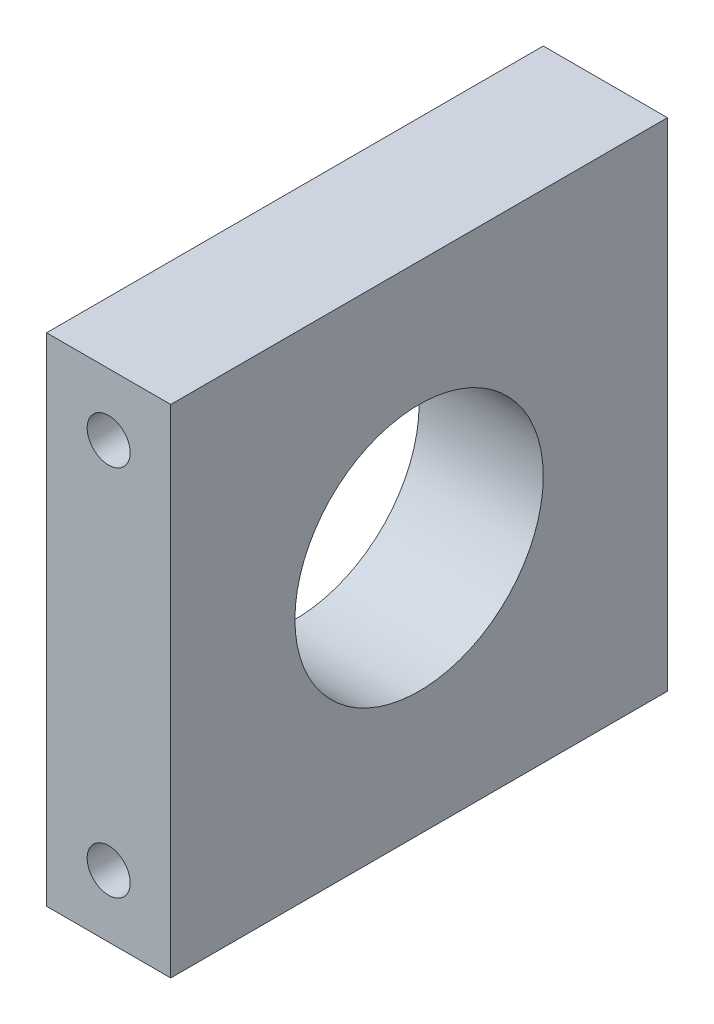
ISO-10303-21;
HEADER;
FILE_DESCRIPTION(('STEP AP214'),'2;1');
FILE_NAME('part.step','',(''),(''),'','','');
FILE_SCHEMA(('AUTOMOTIVE_DESIGN { 1 0 10303 214 1 1 1 1 }'));
ENDSEC;
DATA;
#1=APPLICATION_CONTEXT('core data for automotive mechanical design processes');
#2=APPLICATION_PROTOCOL_DEFINITION('international standard','automotive_design',2000,#1);
#3=PRODUCT_CONTEXT('',#1,'mechanical');
#4=PRODUCT('Part','Part','',(#3));
#5=PRODUCT_RELATED_PRODUCT_CATEGORY('part','',(#4));
#6=PRODUCT_DEFINITION_FORMATION('','',#4);
#7=PRODUCT_DEFINITION_CONTEXT('part definition',#1,'design');
#8=PRODUCT_DEFINITION('design','',#6,#7);
#9=PRODUCT_DEFINITION_SHAPE('','',#8);
#10=(LENGTH_UNIT() NAMED_UNIT(*) SI_UNIT(.MILLI.,.METRE.));
#11=(NAMED_UNIT(*) PLANE_ANGLE_UNIT() SI_UNIT($,.RADIAN.));
#12=(NAMED_UNIT(*) SI_UNIT($,.STERADIAN.) SOLID_ANGLE_UNIT());
#13=UNCERTAINTY_MEASURE_WITH_UNIT(LENGTH_MEASURE(1.E-05),#10,'distance_accuracy_value','');
#14=(GEOMETRIC_REPRESENTATION_CONTEXT(3) GLOBAL_UNCERTAINTY_ASSIGNED_CONTEXT((#13)) GLOBAL_UNIT_ASSIGNED_CONTEXT((#10,
#11,#12)) REPRESENTATION_CONTEXT('',''));
#15=CARTESIAN_POINT('',(0.,0.,0.));
#16=DIRECTION('',(0.,0.,1.));
#17=DIRECTION('',(1.,0.,0.));
#18=AXIS2_PLACEMENT_3D('',#15,#16,#17);
#19=CARTESIAN_POINT('',(9.525,0.,0.));
#20=DIRECTION('',(-1.,0.,0.));
#21=DIRECTION('',(0.,0.,1.));
#22=AXIS2_PLACEMENT_3D('',#19,#20,#21);
#23=PLANE('',#22);
#24=DIRECTION('',(0.,-1.,0.));
#25=VECTOR('',#24,1.);
#26=CARTESIAN_POINT('',(9.525,0.,0.));
#27=LINE('',#26,#25);
#28=CARTESIAN_POINT('',(9.525,38.1,0.));
#29=VERTEX_POINT('',#28);
#30=CARTESIAN_POINT('',(9.525,0.,0.));
#31=VERTEX_POINT('',#30);
#32=EDGE_CURVE('E87',#29,#31,#27,.T.);
#33=ORIENTED_EDGE('',*,*,#32,.T.);
#34=DIRECTION('',(0.,0.,-1.));
#35=VECTOR('',#34,1.);
#36=CARTESIAN_POINT('',(9.525,0.,0.));
#37=LINE('',#36,#35);
#38=CARTESIAN_POINT('',(9.525,0.,-38.1));
#39=VERTEX_POINT('',#38);
#40=EDGE_CURVE('E82',#31,#39,#37,.T.);
#41=ORIENTED_EDGE('',*,*,#40,.T.);
#42=DIRECTION('',(0.,1.,0.));
#43=VECTOR('',#42,1.);
#44=CARTESIAN_POINT('',(9.525,0.,-38.1));
#45=LINE('',#44,#43);
#46=CARTESIAN_POINT('',(9.525,38.1,-38.1));
#47=VERTEX_POINT('',#46);
#48=EDGE_CURVE('E85',#39,#47,#45,.T.);
#49=ORIENTED_EDGE('',*,*,#48,.T.);
#50=DIRECTION('',(0.,0.,1.));
#51=VECTOR('',#50,1.);
#52=CARTESIAN_POINT('',(9.525,38.1,0.));
#53=LINE('',#52,#51);
#54=EDGE_CURVE('E52',#47,#29,#53,.T.);
#55=ORIENTED_EDGE('',*,*,#54,.T.);
#56=EDGE_LOOP('',(#33,#41,#49,#55));
#57=FACE_BOUND('',#56,.T.);
#58=CARTESIAN_POINT('',(9.525,19.05,-19.05));
#59=DIRECTION('',(1.,0.,0.));
#60=DIRECTION('',(0.,0.,-1.));
#61=AXIS2_PLACEMENT_3D('',#58,#59,#60);
#62=CIRCLE('',#61,9.525);
#63=CARTESIAN_POINT('',(9.525,19.05,-28.575));
#64=VERTEX_POINT('',#63);
#65=EDGE_CURVE('E102',#64,#64,#62,.T.);
#66=ORIENTED_EDGE('',*,*,#65,.F.);
#67=EDGE_LOOP('',(#66));
#68=FACE_BOUND('',#67,.T.);
#69=ADVANCED_FACE('F35',(#57,#68),#23,.F.);
#70=CARTESIAN_POINT('',(0.,0.,0.));
#71=DIRECTION('',(-1.,0.,0.));
#72=DIRECTION('',(0.,0.,1.));
#73=AXIS2_PLACEMENT_3D('',#70,#71,#72);
#74=PLANE('',#73);
#75=DIRECTION('',(0.,-1.,0.));
#76=VECTOR('',#75,1.);
#77=CARTESIAN_POINT('',(0.,0.,0.));
#78=LINE('',#77,#76);
#79=CARTESIAN_POINT('',(0.,38.1,0.));
#80=VERTEX_POINT('',#79);
#81=CARTESIAN_POINT('',(0.,0.,0.));
#82=VERTEX_POINT('',#81);
#83=EDGE_CURVE('E99',#80,#82,#78,.T.);
#84=ORIENTED_EDGE('',*,*,#83,.F.);
#85=DIRECTION('',(0.,0.,1.));
#86=VECTOR('',#85,1.);
#87=CARTESIAN_POINT('',(0.,38.1,0.));
#88=LINE('',#87,#86);
#89=CARTESIAN_POINT('',(0.,38.1,-38.1));
#90=VERTEX_POINT('',#89);
#91=EDGE_CURVE('E75',#90,#80,#88,.T.);
#92=ORIENTED_EDGE('',*,*,#91,.F.);
#93=DIRECTION('',(0.,1.,0.));
#94=VECTOR('',#93,1.);
#95=CARTESIAN_POINT('',(0.,0.,-38.1));
#96=LINE('',#95,#94);
#97=CARTESIAN_POINT('',(0.,0.,-38.1));
#98=VERTEX_POINT('',#97);
#99=EDGE_CURVE('E69',#98,#90,#96,.T.);
#100=ORIENTED_EDGE('',*,*,#99,.F.);
#101=DIRECTION('',(0.,0.,-1.));
#102=VECTOR('',#101,1.);
#103=CARTESIAN_POINT('',(0.,0.,0.));
#104=LINE('',#103,#102);
#105=EDGE_CURVE('E91',#82,#98,#104,.T.);
#106=ORIENTED_EDGE('',*,*,#105,.F.);
#107=EDGE_LOOP('',(#84,#92,#100,#106));
#108=FACE_BOUND('',#107,.T.);
#109=CARTESIAN_POINT('',(0.,19.05,-19.05));
#110=DIRECTION('',(1.,0.,0.));
#111=DIRECTION('',(0.,0.,-1.));
#112=AXIS2_PLACEMENT_3D('',#109,#110,#111);
#113=CIRCLE('',#112,9.525);
#114=CARTESIAN_POINT('',(0.,19.05,-28.575));
#115=VERTEX_POINT('',#114);
#116=EDGE_CURVE('E114',#115,#115,#113,.T.);
#117=ORIENTED_EDGE('',*,*,#116,.T.);
#118=EDGE_LOOP('',(#117));
#119=FACE_BOUND('',#118,.T.);
#120=ADVANCED_FACE('F110',(#108,#119),#74,.T.);
#121=CARTESIAN_POINT('',(9.525,0.,0.));
#122=DIRECTION('',(0.,0.,-1.));
#123=DIRECTION('',(-1.,0.,0.));
#124=AXIS2_PLACEMENT_3D('',#121,#122,#123);
#125=PLANE('',#124);
#126=CARTESIAN_POINT('',(4.7625,33.3375,0.));
#127=DIRECTION('',(0.,0.,-1.));
#128=DIRECTION('',(-1.,0.,0.));
#129=AXIS2_PLACEMENT_3D('',#126,#127,#128);
#130=CIRCLE('',#129,1.64999999999999);
#131=CARTESIAN_POINT('',(3.11250000000001,33.3375,0.));
#132=VERTEX_POINT('',#131);
#133=EDGE_CURVE('E125',#132,#132,#130,.T.);
#134=ORIENTED_EDGE('',*,*,#133,.T.);
#135=EDGE_LOOP('',(#134));
#136=FACE_BOUND('',#135,.T.);
#137=CARTESIAN_POINT('',(4.7625,4.7625,0.));
#138=DIRECTION('',(0.,0.,-1.));
#139=DIRECTION('',(-1.,0.,0.));
#140=AXIS2_PLACEMENT_3D('',#137,#138,#139);
#141=CIRCLE('',#140,1.64999999999999);
#142=CARTESIAN_POINT('',(3.11250000000001,4.7625,0.));
#143=VERTEX_POINT('',#142);
#144=EDGE_CURVE('E117',#143,#143,#141,.T.);
#145=ORIENTED_EDGE('',*,*,#144,.T.);
#146=EDGE_LOOP('',(#145));
#147=FACE_BOUND('',#146,.T.);
#148=ORIENTED_EDGE('',*,*,#83,.T.);
#149=DIRECTION('',(-1.,0.,0.));
#150=VECTOR('',#149,1.);
#151=CARTESIAN_POINT('',(9.525,0.,0.));
#152=LINE('',#151,#150);
#153=EDGE_CURVE('E11',#31,#82,#152,.T.);
#154=ORIENTED_EDGE('',*,*,#153,.F.);
#155=ORIENTED_EDGE('',*,*,#32,.F.);
#156=DIRECTION('',(-1.,0.,0.));
#157=VECTOR('',#156,1.);
#158=CARTESIAN_POINT('',(9.525,38.1,0.));
#159=LINE('',#158,#157);
#160=EDGE_CURVE('E95',#29,#80,#159,.T.);
#161=ORIENTED_EDGE('',*,*,#160,.T.);
#162=EDGE_LOOP('',(#148,#154,#155,#161));
#163=FACE_BOUND('',#162,.T.);
#164=ADVANCED_FACE('F37',(#136,#147,#163),#125,.F.);
#165=CARTESIAN_POINT('',(9.525,0.,0.));
#166=DIRECTION('',(0.,1.,0.));
#167=DIRECTION('',(0.,0.,1.));
#168=AXIS2_PLACEMENT_3D('',#165,#166,#167);
#169=PLANE('',#168);
#170=ORIENTED_EDGE('',*,*,#105,.T.);
#171=DIRECTION('',(-1.,0.,0.));
#172=VECTOR('',#171,1.);
#173=CARTESIAN_POINT('',(9.525,0.,-38.1));
#174=LINE('',#173,#172);
#175=EDGE_CURVE('E44',#39,#98,#174,.T.);
#176=ORIENTED_EDGE('',*,*,#175,.F.);
#177=ORIENTED_EDGE('',*,*,#40,.F.);
#178=ORIENTED_EDGE('',*,*,#153,.T.);
#179=EDGE_LOOP('',(#170,#176,#177,#178));
#180=FACE_BOUND('',#179,.T.);
#181=ADVANCED_FACE('F90',(#180),#169,.F.);
#182=CARTESIAN_POINT('',(9.525,0.,-38.1));
#183=DIRECTION('',(0.,0.,1.));
#184=DIRECTION('',(1.,0.,0.));
#185=AXIS2_PLACEMENT_3D('',#182,#183,#184);
#186=PLANE('',#185);
#187=CARTESIAN_POINT('',(4.7625,33.3375,-38.1));
#188=DIRECTION('',(0.,0.,-1.));
#189=DIRECTION('',(-1.,0.,0.));
#190=AXIS2_PLACEMENT_3D('',#187,#188,#189);
#191=CIRCLE('',#190,1.65);
#192=CARTESIAN_POINT('',(3.1125,33.3375,-38.1));
#193=VERTEX_POINT('',#192);
#194=EDGE_CURVE('E128',#193,#193,#191,.T.);
#195=ORIENTED_EDGE('',*,*,#194,.F.);
#196=EDGE_LOOP('',(#195));
#197=FACE_BOUND('',#196,.T.);
#198=CARTESIAN_POINT('',(4.7625,4.7625,-38.1));
#199=DIRECTION('',(0.,0.,-1.));
#200=DIRECTION('',(-1.,0.,0.));
#201=AXIS2_PLACEMENT_3D('',#198,#199,#200);
#202=CIRCLE('',#201,1.65);
#203=CARTESIAN_POINT('',(3.1125,4.7625,-38.1));
#204=VERTEX_POINT('',#203);
#205=EDGE_CURVE('E122',#204,#204,#202,.T.);
#206=ORIENTED_EDGE('',*,*,#205,.F.);
#207=EDGE_LOOP('',(#206));
#208=FACE_BOUND('',#207,.T.);
#209=ORIENTED_EDGE('',*,*,#99,.T.);
#210=DIRECTION('',(-1.,0.,0.));
#211=VECTOR('',#210,1.);
#212=CARTESIAN_POINT('',(9.525,38.1,-38.1));
#213=LINE('',#212,#211);
#214=EDGE_CURVE('E92',#47,#90,#213,.T.);
#215=ORIENTED_EDGE('',*,*,#214,.F.);
#216=ORIENTED_EDGE('',*,*,#48,.F.);
#217=ORIENTED_EDGE('',*,*,#175,.T.);
#218=EDGE_LOOP('',(#209,#215,#216,#217));
#219=FACE_BOUND('',#218,.T.);
#220=ADVANCED_FACE('F93',(#197,#208,#219),#186,.F.);
#221=CARTESIAN_POINT('',(9.525,38.1,0.));
#222=DIRECTION('',(0.,-1.,0.));
#223=DIRECTION('',(0.,0.,-1.));
#224=AXIS2_PLACEMENT_3D('',#221,#222,#223);
#225=PLANE('',#224);
#226=ORIENTED_EDGE('',*,*,#91,.T.);
#227=ORIENTED_EDGE('',*,*,#160,.F.);
#228=ORIENTED_EDGE('',*,*,#54,.F.);
#229=ORIENTED_EDGE('',*,*,#214,.T.);
#230=EDGE_LOOP('',(#226,#227,#228,#229));
#231=FACE_BOUND('',#230,.T.);
#232=ADVANCED_FACE('F107',(#231),#225,.F.);
#233=CARTESIAN_POINT('',(9.525,19.05,-19.05));
#234=DIRECTION('',(-1.,0.,0.));
#235=DIRECTION('',(0.,0.,1.));
#236=AXIS2_PLACEMENT_3D('',#233,#234,#235);
#237=CYLINDRICAL_SURFACE('',#236,9.525);
#238=ORIENTED_EDGE('',*,*,#65,.T.);
#239=EDGE_LOOP('',(#238));
#240=FACE_BOUND('',#239,.T.);
#241=ORIENTED_EDGE('',*,*,#116,.F.);
#242=EDGE_LOOP('',(#241));
#243=FACE_BOUND('',#242,.T.);
#244=ADVANCED_FACE('F141',(#240,#243),#237,.F.);
#245=CARTESIAN_POINT('',(4.7625,4.7625,-38.1));
#246=DIRECTION('',(0.,0.,-1.));
#247=DIRECTION('',(-1.,0.,0.));
#248=AXIS2_PLACEMENT_3D('',#245,#246,#247);
#249=CYLINDRICAL_SURFACE('',#248,1.65);
#250=ORIENTED_EDGE('',*,*,#144,.F.);
#251=EDGE_LOOP('',(#250));
#252=FACE_BOUND('',#251,.T.);
#253=ORIENTED_EDGE('',*,*,#205,.T.);
#254=EDGE_LOOP('',(#253));
#255=FACE_BOUND('',#254,.T.);
#256=ADVANCED_FACE('F139',(#252,#255),#249,.F.);
#257=CARTESIAN_POINT('',(4.7625,33.3375,-38.1));
#258=DIRECTION('',(0.,0.,-1.));
#259=DIRECTION('',(-1.,0.,0.));
#260=AXIS2_PLACEMENT_3D('',#257,#258,#259);
#261=CYLINDRICAL_SURFACE('',#260,1.65);
#262=ORIENTED_EDGE('',*,*,#133,.F.);
#263=EDGE_LOOP('',(#262));
#264=FACE_BOUND('',#263,.T.);
#265=ORIENTED_EDGE('',*,*,#194,.T.);
#266=EDGE_LOOP('',(#265));
#267=FACE_BOUND('',#266,.T.);
#268=ADVANCED_FACE('F132',(#264,#267),#261,.F.);
#269=CLOSED_SHELL('',(#69,#120,#164,#181,#220,#232,#244,#256,#268));
#270=MANIFOLD_SOLID_BREP('B2',#269);
#271=ADVANCED_BREP_SHAPE_REPRESENTATION('',(#18,#270),#14);
#272=SHAPE_DEFINITION_REPRESENTATION(#9,#271);
ENDSEC;
END-ISO-10303-21;
